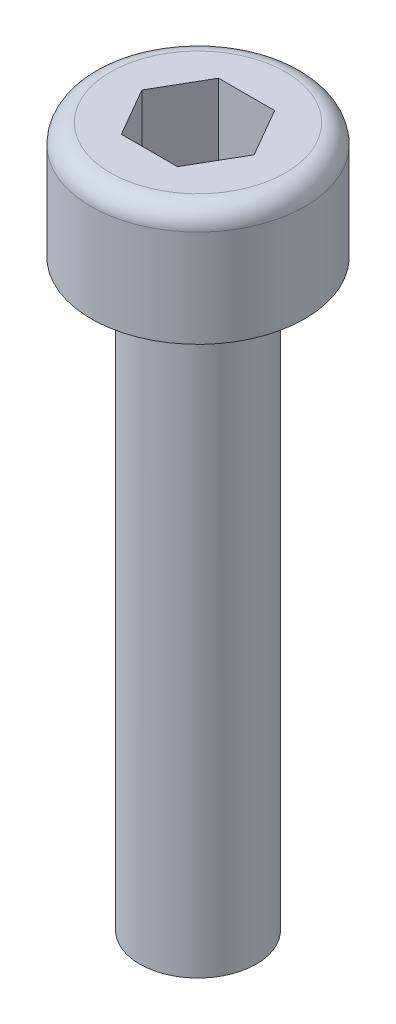
ISO-10303-21;
HEADER;
FILE_DESCRIPTION(('STEP AP214'),'2;1');
FILE_NAME('part.step','',(''),(''),'','','');
FILE_SCHEMA(('AUTOMOTIVE_DESIGN { 1 0 10303 214 1 1 1 1 }'));
ENDSEC;
DATA;
#1=APPLICATION_CONTEXT('core data for automotive mechanical design processes');
#2=APPLICATION_PROTOCOL_DEFINITION('international standard','automotive_design',2000,#1);
#3=PRODUCT_CONTEXT('',#1,'mechanical');
#4=PRODUCT('Part','Part','',(#3));
#5=PRODUCT_RELATED_PRODUCT_CATEGORY('part','',(#4));
#6=PRODUCT_DEFINITION_FORMATION('','',#4);
#7=PRODUCT_DEFINITION_CONTEXT('part definition',#1,'design');
#8=PRODUCT_DEFINITION('design','',#6,#7);
#9=PRODUCT_DEFINITION_SHAPE('','',#8);
#10=(LENGTH_UNIT() NAMED_UNIT(*) SI_UNIT(.MILLI.,.METRE.));
#11=(NAMED_UNIT(*) PLANE_ANGLE_UNIT() SI_UNIT($,.RADIAN.));
#12=(NAMED_UNIT(*) SI_UNIT($,.STERADIAN.) SOLID_ANGLE_UNIT());
#13=UNCERTAINTY_MEASURE_WITH_UNIT(LENGTH_MEASURE(1.E-05),#10,'distance_accuracy_value','');
#14=(GEOMETRIC_REPRESENTATION_CONTEXT(3) GLOBAL_UNCERTAINTY_ASSIGNED_CONTEXT((#13)) GLOBAL_UNIT_ASSIGNED_CONTEXT((#10,
#11,#12)) REPRESENTATION_CONTEXT('',''));
#15=CARTESIAN_POINT('',(0.,0.,0.));
#16=DIRECTION('',(0.,0.,1.));
#17=DIRECTION('',(1.,0.,0.));
#18=AXIS2_PLACEMENT_3D('',#15,#16,#17);
#19=CARTESIAN_POINT('',(0.,2.5,0.));
#20=DIRECTION('',(0.,-1.,0.));
#21=DIRECTION('',(1.,0.,0.));
#22=AXIS2_PLACEMENT_3D('',#19,#20,#21);
#23=TOROIDAL_SURFACE('',#22,2.25,0.5);
#24=CARTESIAN_POINT('',(0.,3.,0.));
#25=DIRECTION('',(0.,-1.,0.));
#26=DIRECTION('',(1.,0.,0.));
#27=AXIS2_PLACEMENT_3D('',#24,#25,#26);
#28=CIRCLE('',#27,2.25);
#29=CARTESIAN_POINT('',(2.25,3.,0.));
#30=VERTEX_POINT('',#29);
#31=EDGE_CURVE('E135',#30,#30,#28,.T.);
#32=ORIENTED_EDGE('',*,*,#31,.T.);
#33=EDGE_LOOP('',(#32));
#34=FACE_BOUND('',#33,.T.);
#35=CARTESIAN_POINT('',(0.,2.5,0.));
#36=DIRECTION('',(0.,-1.,0.));
#37=DIRECTION('',(1.,0.,0.));
#38=AXIS2_PLACEMENT_3D('',#35,#36,#37);
#39=CIRCLE('',#38,2.75);
#40=CARTESIAN_POINT('',(2.75,2.5,0.));
#41=VERTEX_POINT('',#40);
#42=EDGE_CURVE('E11',#41,#41,#39,.T.);
#43=ORIENTED_EDGE('',*,*,#42,.F.);
#44=EDGE_LOOP('',(#43));
#45=FACE_BOUND('',#44,.T.);
#46=ADVANCED_FACE('F32',(#34,#45),#23,.T.);
#47=CARTESIAN_POINT('',(0.,3.,0.));
#48=DIRECTION('',(0.,-1.,0.));
#49=DIRECTION('',(1.,0.,0.));
#50=AXIS2_PLACEMENT_3D('',#47,#48,#49);
#51=CYLINDRICAL_SURFACE('',#50,2.75);
#52=ORIENTED_EDGE('',*,*,#42,.T.);
#53=EDGE_LOOP('',(#52));
#54=FACE_BOUND('',#53,.T.);
#55=CARTESIAN_POINT('',(0.,0.,0.));
#56=DIRECTION('',(0.,-1.,0.));
#57=DIRECTION('',(1.,0.,0.));
#58=AXIS2_PLACEMENT_3D('',#55,#56,#57);
#59=CIRCLE('',#58,2.75);
#60=CARTESIAN_POINT('',(2.75,0.,0.));
#61=VERTEX_POINT('',#60);
#62=EDGE_CURVE('E39',#61,#61,#59,.T.);
#63=ORIENTED_EDGE('',*,*,#62,.F.);
#64=EDGE_LOOP('',(#63));
#65=FACE_BOUND('',#64,.T.);
#66=ADVANCED_FACE('F155',(#54,#65),#51,.T.);
#67=CARTESIAN_POINT('',(2.75,0.,0.));
#68=DIRECTION('',(0.,-1.,0.));
#69=DIRECTION('',(1.,0.,0.));
#70=AXIS2_PLACEMENT_3D('',#67,#68,#69);
#71=PLANE('',#70);
#72=ORIENTED_EDGE('',*,*,#62,.T.);
#73=EDGE_LOOP('',(#72));
#74=FACE_BOUND('',#73,.T.);
#75=CARTESIAN_POINT('',(0.,0.,0.));
#76=DIRECTION('',(0.,-1.,0.));
#77=DIRECTION('',(1.,0.,0.));
#78=AXIS2_PLACEMENT_3D('',#75,#76,#77);
#79=CIRCLE('',#78,1.5);
#80=CARTESIAN_POINT('',(1.5,0.,0.));
#81=VERTEX_POINT('',#80);
#82=EDGE_CURVE('E147',#81,#81,#79,.T.);
#83=ORIENTED_EDGE('',*,*,#82,.F.);
#84=EDGE_LOOP('',(#83));
#85=FACE_BOUND('',#84,.T.);
#86=ADVANCED_FACE('F152',(#74,#85),#71,.T.);
#87=CARTESIAN_POINT('',(0.,3.,0.));
#88=DIRECTION('',(0.,-1.,0.));
#89=DIRECTION('',(1.,0.,0.));
#90=AXIS2_PLACEMENT_3D('',#87,#88,#89);
#91=CYLINDRICAL_SURFACE('',#90,1.5);
#92=ORIENTED_EDGE('',*,*,#82,.T.);
#93=EDGE_LOOP('',(#92));
#94=FACE_BOUND('',#93,.T.);
#95=CARTESIAN_POINT('',(0.,-15.,0.));
#96=DIRECTION('',(0.,-1.,0.));
#97=DIRECTION('',(1.,0.,0.));
#98=AXIS2_PLACEMENT_3D('',#95,#96,#97);
#99=CIRCLE('',#98,1.5);
#100=CARTESIAN_POINT('',(1.5,-15.,0.));
#101=VERTEX_POINT('',#100);
#102=EDGE_CURVE('E144',#101,#101,#99,.T.);
#103=ORIENTED_EDGE('',*,*,#102,.F.);
#104=EDGE_LOOP('',(#103));
#105=FACE_BOUND('',#104,.T.);
#106=ADVANCED_FACE('F162',(#94,#105),#91,.T.);
#107=CARTESIAN_POINT('',(0.,-15.4019237886467,0.));
#108=DIRECTION('',(0.,1.,0.));
#109=DIRECTION('',(-1.,0.,0.));
#110=AXIS2_PLACEMENT_3D('',#107,#108,#109);
#111=CONICAL_SURFACE('',#110,0.,1.30899693899574);
#112=ORIENTED_EDGE('',*,*,#102,.T.);
#113=EDGE_LOOP('',(#112));
#114=FACE_BOUND('',#113,.T.);
#115=CARTESIAN_POINT('',(0.,-15.4019237886467,0.));
#116=VERTEX_POINT('',#115);
#117=VERTEX_LOOP('',#116);
#118=FACE_BOUND('',#117,.T.);
#119=ADVANCED_FACE('F168',(#114,#118),#111,.T.);
#120=CARTESIAN_POINT('',(0.,3.,0.));
#121=DIRECTION('',(0.,1.,0.));
#122=DIRECTION('',(-1.,0.,0.));
#123=AXIS2_PLACEMENT_3D('',#120,#121,#122);
#124=PLANE('',#123);
#125=DIRECTION('',(0.500000000000001,0.,-0.866025403784442));
#126=VECTOR('',#125,1.);
#127=CARTESIAN_POINT('',(0.721687836487028,3.,1.25));
#128=LINE('',#127,#126);
#129=CARTESIAN_POINT('',(0.721687836487028,3.,1.25));
#130=VERTEX_POINT('',#129);
#131=CARTESIAN_POINT('',(1.44337567297405,3.,0.));
#132=VERTEX_POINT('',#131);
#133=EDGE_CURVE('E46',#130,#132,#128,.T.);
#134=ORIENTED_EDGE('',*,*,#133,.F.);
#135=DIRECTION('',(1.,0.,0.));
#136=VECTOR('',#135,1.);
#137=CARTESIAN_POINT('',(-0.721687836487031,3.,1.25));
#138=LINE('',#137,#136);
#139=CARTESIAN_POINT('',(-0.721687836487031,3.,1.25));
#140=VERTEX_POINT('',#139);
#141=EDGE_CURVE('E115',#140,#130,#138,.T.);
#142=ORIENTED_EDGE('',*,*,#141,.F.);
#143=DIRECTION('',(0.500000000000002,0.,0.866025403784442));
#144=VECTOR('',#143,1.);
#145=CARTESIAN_POINT('',(-1.44337567297407,3.,0.));
#146=LINE('',#145,#144);
#147=CARTESIAN_POINT('',(-1.44337567297407,3.,0.));
#148=VERTEX_POINT('',#147);
#149=EDGE_CURVE('E109',#148,#140,#146,.T.);
#150=ORIENTED_EDGE('',*,*,#149,.F.);
#151=DIRECTION('',(-0.500000000000002,0.,0.866025403784441));
#152=VECTOR('',#151,1.);
#153=CARTESIAN_POINT('',(-0.721687836487031,3.,-1.25));
#154=LINE('',#153,#152);
#155=CARTESIAN_POINT('',(-0.721687836487031,3.,-1.25));
#156=VERTEX_POINT('',#155);
#157=EDGE_CURVE('E107',#156,#148,#154,.T.);
#158=ORIENTED_EDGE('',*,*,#157,.F.);
#159=DIRECTION('',(-1.,0.,0.));
#160=VECTOR('',#159,1.);
#161=CARTESIAN_POINT('',(0.721687836487028,3.,-1.25));
#162=LINE('',#161,#160);
#163=CARTESIAN_POINT('',(0.721687836487028,3.,-1.25));
#164=VERTEX_POINT('',#163);
#165=EDGE_CURVE('E88',#164,#156,#162,.T.);
#166=ORIENTED_EDGE('',*,*,#165,.F.);
#167=DIRECTION('',(-0.500000000000001,0.,-0.866025403784441));
#168=VECTOR('',#167,1.);
#169=CARTESIAN_POINT('',(1.44337567297405,3.,0.));
#170=LINE('',#169,#168);
#171=EDGE_CURVE('E99',#132,#164,#170,.T.);
#172=ORIENTED_EDGE('',*,*,#171,.F.);
#173=EDGE_LOOP('',(#134,#142,#150,#158,#166,#172));
#174=FACE_BOUND('',#173,.T.);
#175=ORIENTED_EDGE('',*,*,#31,.F.);
#176=EDGE_LOOP('',(#175));
#177=FACE_BOUND('',#176,.T.);
#178=ADVANCED_FACE('F103',(#174,#177),#124,.T.);
#179=CARTESIAN_POINT('',(0.721687836487028,1.,1.25));
#180=DIRECTION('',(0.866025403784442,0.,0.500000000000001));
#181=DIRECTION('',(0.500000000000001,0.,-0.866025403784442));
#182=AXIS2_PLACEMENT_3D('',#179,#180,#181);
#183=PLANE('',#182);
#184=ORIENTED_EDGE('',*,*,#133,.T.);
#185=DIRECTION('',(0.,1.,0.));
#186=VECTOR('',#185,1.);
#187=CARTESIAN_POINT('',(1.44337567297405,1.,0.));
#188=LINE('',#187,#186);
#189=CARTESIAN_POINT('',(1.44337567297405,1.,0.));
#190=VERTEX_POINT('',#189);
#191=EDGE_CURVE('E96',#190,#132,#188,.T.);
#192=ORIENTED_EDGE('',*,*,#191,.F.);
#193=DIRECTION('',(0.500000000000001,0.,-0.866025403784442));
#194=VECTOR('',#193,1.);
#195=CARTESIAN_POINT('',(0.721687836487028,1.,1.25));
#196=LINE('',#195,#194);
#197=CARTESIAN_POINT('',(0.721687836487028,1.,1.25));
#198=VERTEX_POINT('',#197);
#199=EDGE_CURVE('E118',#198,#190,#196,.T.);
#200=ORIENTED_EDGE('',*,*,#199,.F.);
#201=DIRECTION('',(0.,1.,0.));
#202=VECTOR('',#201,1.);
#203=CARTESIAN_POINT('',(0.721687836487028,1.,1.25));
#204=LINE('',#203,#202);
#205=EDGE_CURVE('E133',#198,#130,#204,.T.);
#206=ORIENTED_EDGE('',*,*,#205,.T.);
#207=EDGE_LOOP('',(#184,#192,#200,#206));
#208=FACE_BOUND('',#207,.T.);
#209=ADVANCED_FACE('F175',(#208),#183,.F.);
#210=CARTESIAN_POINT('',(-0.721687836487031,1.,1.25));
#211=DIRECTION('',(0.,0.,1.));
#212=DIRECTION('',(1.,0.,0.));
#213=AXIS2_PLACEMENT_3D('',#210,#211,#212);
#214=PLANE('',#213);
#215=ORIENTED_EDGE('',*,*,#141,.T.);
#216=ORIENTED_EDGE('',*,*,#205,.F.);
#217=DIRECTION('',(1.,0.,0.));
#218=VECTOR('',#217,1.);
#219=CARTESIAN_POINT('',(-0.721687836487031,1.,1.25));
#220=LINE('',#219,#218);
#221=CARTESIAN_POINT('',(-0.721687836487031,1.,1.25));
#222=VERTEX_POINT('',#221);
#223=EDGE_CURVE('E130',#222,#198,#220,.T.);
#224=ORIENTED_EDGE('',*,*,#223,.F.);
#225=DIRECTION('',(0.,1.,0.));
#226=VECTOR('',#225,1.);
#227=CARTESIAN_POINT('',(-0.721687836487031,1.,1.25));
#228=LINE('',#227,#226);
#229=EDGE_CURVE('E136',#222,#140,#228,.T.);
#230=ORIENTED_EDGE('',*,*,#229,.T.);
#231=EDGE_LOOP('',(#215,#216,#224,#230));
#232=FACE_BOUND('',#231,.T.);
#233=ADVANCED_FACE('F178',(#232),#214,.F.);
#234=CARTESIAN_POINT('',(-1.44337567297407,1.,0.));
#235=DIRECTION('',(-0.866025403784442,0.,0.500000000000002));
#236=DIRECTION('',(0.500000000000002,0.,0.866025403784442));
#237=AXIS2_PLACEMENT_3D('',#234,#235,#236);
#238=PLANE('',#237);
#239=ORIENTED_EDGE('',*,*,#149,.T.);
#240=ORIENTED_EDGE('',*,*,#229,.F.);
#241=DIRECTION('',(0.500000000000002,0.,0.866025403784442));
#242=VECTOR('',#241,1.);
#243=CARTESIAN_POINT('',(-1.44337567297407,1.,0.));
#244=LINE('',#243,#242);
#245=CARTESIAN_POINT('',(-1.44337567297407,1.,0.));
#246=VERTEX_POINT('',#245);
#247=EDGE_CURVE('E127',#246,#222,#244,.T.);
#248=ORIENTED_EDGE('',*,*,#247,.F.);
#249=DIRECTION('',(0.,1.,0.));
#250=VECTOR('',#249,1.);
#251=CARTESIAN_POINT('',(-1.44337567297407,1.,0.));
#252=LINE('',#251,#250);
#253=EDGE_CURVE('E138',#246,#148,#252,.T.);
#254=ORIENTED_EDGE('',*,*,#253,.T.);
#255=EDGE_LOOP('',(#239,#240,#248,#254));
#256=FACE_BOUND('',#255,.T.);
#257=ADVANCED_FACE('F187',(#256),#238,.F.);
#258=CARTESIAN_POINT('',(-0.721687836487031,1.,-1.25));
#259=DIRECTION('',(-0.866025403784441,0.,-0.500000000000002));
#260=DIRECTION('',(-0.500000000000002,0.,0.866025403784441));
#261=AXIS2_PLACEMENT_3D('',#258,#259,#260);
#262=PLANE('',#261);
#263=ORIENTED_EDGE('',*,*,#157,.T.);
#264=ORIENTED_EDGE('',*,*,#253,.F.);
#265=DIRECTION('',(-0.500000000000002,0.,0.866025403784441));
#266=VECTOR('',#265,1.);
#267=CARTESIAN_POINT('',(-0.721687836487031,1.,-1.25));
#268=LINE('',#267,#266);
#269=CARTESIAN_POINT('',(-0.721687836487031,1.,-1.25));
#270=VERTEX_POINT('',#269);
#271=EDGE_CURVE('E124',#270,#246,#268,.T.);
#272=ORIENTED_EDGE('',*,*,#271,.F.);
#273=DIRECTION('',(0.,1.,0.));
#274=VECTOR('',#273,1.);
#275=CARTESIAN_POINT('',(-0.721687836487031,1.,-1.25));
#276=LINE('',#275,#274);
#277=EDGE_CURVE('E95',#270,#156,#276,.T.);
#278=ORIENTED_EDGE('',*,*,#277,.T.);
#279=EDGE_LOOP('',(#263,#264,#272,#278));
#280=FACE_BOUND('',#279,.T.);
#281=ADVANCED_FACE('F184',(#280),#262,.F.);
#282=CARTESIAN_POINT('',(0.721687836487028,1.,-1.25));
#283=DIRECTION('',(0.,0.,-1.));
#284=DIRECTION('',(-1.,0.,0.));
#285=AXIS2_PLACEMENT_3D('',#282,#283,#284);
#286=PLANE('',#285);
#287=ORIENTED_EDGE('',*,*,#165,.T.);
#288=ORIENTED_EDGE('',*,*,#277,.F.);
#289=DIRECTION('',(-1.,0.,0.));
#290=VECTOR('',#289,1.);
#291=CARTESIAN_POINT('',(0.721687836487028,1.,-1.25));
#292=LINE('',#291,#290);
#293=CARTESIAN_POINT('',(0.721687836487028,1.,-1.25));
#294=VERTEX_POINT('',#293);
#295=EDGE_CURVE('E91',#294,#270,#292,.T.);
#296=ORIENTED_EDGE('',*,*,#295,.F.);
#297=DIRECTION('',(0.,1.,0.));
#298=VECTOR('',#297,1.);
#299=CARTESIAN_POINT('',(0.721687836487028,1.,-1.25));
#300=LINE('',#299,#298);
#301=EDGE_CURVE('E84',#294,#164,#300,.T.);
#302=ORIENTED_EDGE('',*,*,#301,.T.);
#303=EDGE_LOOP('',(#287,#288,#296,#302));
#304=FACE_BOUND('',#303,.T.);
#305=ADVANCED_FACE('F86',(#304),#286,.F.);
#306=CARTESIAN_POINT('',(1.44337567297405,1.,0.));
#307=DIRECTION('',(0.866025403784441,0.,-0.500000000000001));
#308=DIRECTION('',(-0.500000000000001,0.,-0.866025403784441));
#309=AXIS2_PLACEMENT_3D('',#306,#307,#308);
#310=PLANE('',#309);
#311=ORIENTED_EDGE('',*,*,#171,.T.);
#312=ORIENTED_EDGE('',*,*,#301,.F.);
#313=DIRECTION('',(-0.500000000000001,0.,-0.866025403784441));
#314=VECTOR('',#313,1.);
#315=CARTESIAN_POINT('',(1.44337567297405,1.,0.));
#316=LINE('',#315,#314);
#317=EDGE_CURVE('E121',#190,#294,#316,.T.);
#318=ORIENTED_EDGE('',*,*,#317,.F.);
#319=ORIENTED_EDGE('',*,*,#191,.T.);
#320=EDGE_LOOP('',(#311,#312,#318,#319));
#321=FACE_BOUND('',#320,.T.);
#322=ADVANCED_FACE('F100',(#321),#310,.F.);
#323=CARTESIAN_POINT('',(0.721687836487028,1.,1.25));
#324=DIRECTION('',(0.,-1.,0.));
#325=DIRECTION('',(0.,0.,-1.));
#326=AXIS2_PLACEMENT_3D('',#323,#324,#325);
#327=PLANE('',#326);
#328=ORIENTED_EDGE('',*,*,#199,.T.);
#329=ORIENTED_EDGE('',*,*,#317,.T.);
#330=ORIENTED_EDGE('',*,*,#295,.T.);
#331=ORIENTED_EDGE('',*,*,#271,.T.);
#332=ORIENTED_EDGE('',*,*,#247,.T.);
#333=ORIENTED_EDGE('',*,*,#223,.T.);
#334=EDGE_LOOP('',(#328,#329,#330,#331,#332,#333));
#335=FACE_BOUND('',#334,.T.);
#336=ADVANCED_FACE('F181',(#335),#327,.F.);
#337=CLOSED_SHELL('',(#46,#66,#86,#106,#119,#178,#209,#233,#257,#281,#305,#322,#336));
#338=MANIFOLD_SOLID_BREP('B2',#337);
#339=ADVANCED_BREP_SHAPE_REPRESENTATION('',(#18,#338),#14);
#340=SHAPE_DEFINITION_REPRESENTATION(#9,#339);
ENDSEC;
END-ISO-10303-21;
